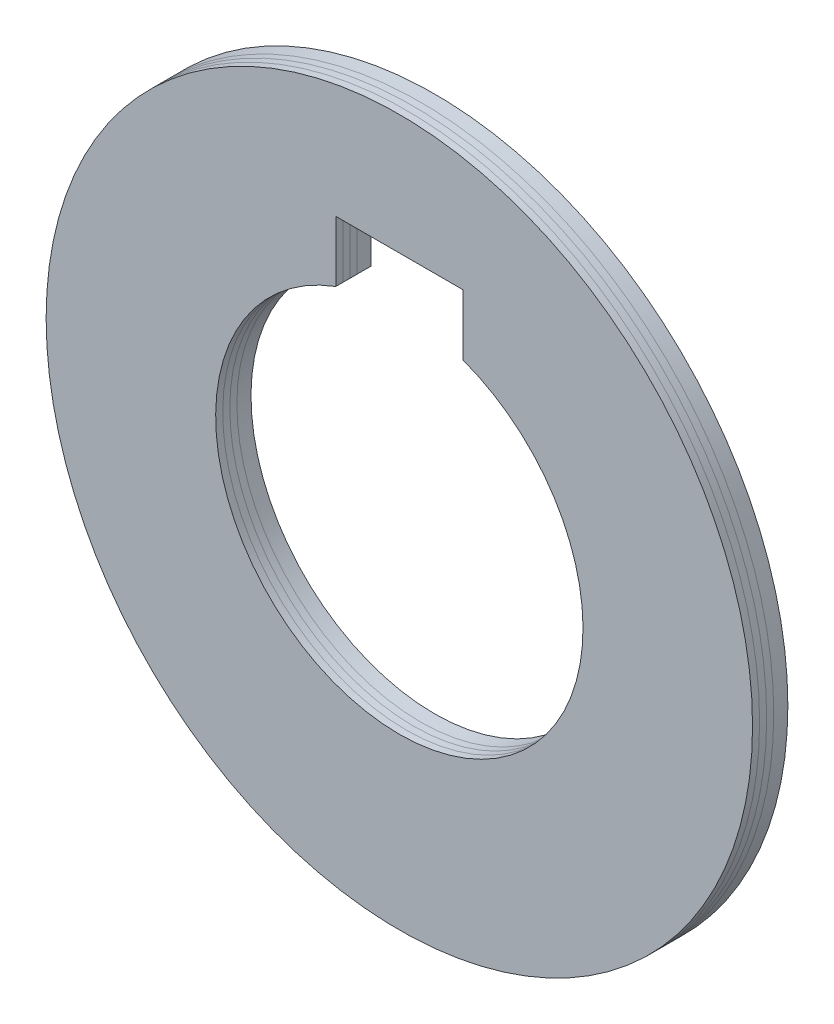
ISO-10303-21;
HEADER;
FILE_DESCRIPTION(('STEP AP214'),'2;1');
FILE_NAME('part.step','',(''),(''),'','','');
FILE_SCHEMA(('AUTOMOTIVE_DESIGN { 1 0 10303 214 1 1 1 1 }'));
ENDSEC;
DATA;
#1=APPLICATION_CONTEXT('core data for automotive mechanical design processes');
#2=APPLICATION_PROTOCOL_DEFINITION('international standard','automotive_design',2000,#1);
#3=PRODUCT_CONTEXT('',#1,'mechanical');
#4=PRODUCT('Part','Part','',(#3));
#5=PRODUCT_RELATED_PRODUCT_CATEGORY('part','',(#4));
#6=PRODUCT_DEFINITION_FORMATION('','',#4);
#7=PRODUCT_DEFINITION_CONTEXT('part definition',#1,'design');
#8=PRODUCT_DEFINITION('design','',#6,#7);
#9=PRODUCT_DEFINITION_SHAPE('','',#8);
#10=(LENGTH_UNIT() NAMED_UNIT(*) SI_UNIT(.MILLI.,.METRE.));
#11=(NAMED_UNIT(*) PLANE_ANGLE_UNIT() SI_UNIT($,.RADIAN.));
#12=(NAMED_UNIT(*) SI_UNIT($,.STERADIAN.) SOLID_ANGLE_UNIT());
#13=UNCERTAINTY_MEASURE_WITH_UNIT(LENGTH_MEASURE(1.E-05),#10,'distance_accuracy_value','');
#14=(GEOMETRIC_REPRESENTATION_CONTEXT(3) GLOBAL_UNCERTAINTY_ASSIGNED_CONTEXT((#13)) GLOBAL_UNIT_ASSIGNED_CONTEXT((#10,
#11,#12)) REPRESENTATION_CONTEXT('',''));
#15=CARTESIAN_POINT('',(0.,0.,0.));
#16=DIRECTION('',(0.,0.,1.));
#17=DIRECTION('',(1.,0.,0.));
#18=AXIS2_PLACEMENT_3D('',#15,#16,#17);
#19=CARTESIAN_POINT('',(-25.,-25.01,1.));
#20=DIRECTION('',(0.,0.,1.));
#21=DIRECTION('',(1.,0.,0.));
#22=AXIS2_PLACEMENT_3D('',#19,#20,#21);
#23=PLANE('',#22);
#24=CARTESIAN_POINT('',(0.,0.,1.));
#25=DIRECTION('',(0.,0.,1.));
#26=DIRECTION('',(1.,0.,0.));
#27=AXIS2_PLACEMENT_3D('',#24,#25,#26);
#28=CIRCLE('',#27,25.);
#29=CARTESIAN_POINT('',(25.,0.,1.));
#30=VERTEX_POINT('',#29);
#31=EDGE_CURVE('E101',#30,#30,#28,.T.);
#32=ORIENTED_EDGE('',*,*,#31,.T.);
#33=EDGE_LOOP('',(#32));
#34=FACE_BOUND('',#33,.T.);
#35=CARTESIAN_POINT('',(0.,0.,1.));
#36=DIRECTION('',(0.,0.,1.));
#37=DIRECTION('',(1.,0.,0.));
#38=AXIS2_PLACEMENT_3D('',#35,#36,#37);
#39=CIRCLE('',#38,13.);
#40=CARTESIAN_POINT('',(-4.5,12.1963109176505,1.));
#41=VERTEX_POINT('',#40);
#42=CARTESIAN_POINT('',(4.5,12.1963109176505,1.));
#43=VERTEX_POINT('',#42);
#44=EDGE_CURVE('E94',#41,#43,#39,.T.);
#45=ORIENTED_EDGE('',*,*,#44,.F.);
#46=DIRECTION('',(0.,-1.,0.));
#47=VECTOR('',#46,1.);
#48=CARTESIAN_POINT('',(-4.5,16.5,1.));
#49=LINE('',#48,#47);
#50=CARTESIAN_POINT('',(-4.5,16.5,1.));
#51=VERTEX_POINT('',#50);
#52=EDGE_CURVE('E108',#51,#41,#49,.T.);
#53=ORIENTED_EDGE('',*,*,#52,.F.);
#54=DIRECTION('',(-1.,0.,0.));
#55=VECTOR('',#54,1.);
#56=CARTESIAN_POINT('',(-4.5,16.5,1.));
#57=LINE('',#56,#55);
#58=CARTESIAN_POINT('',(4.5,16.5,1.));
#59=VERTEX_POINT('',#58);
#60=EDGE_CURVE('E97',#59,#51,#57,.T.);
#61=ORIENTED_EDGE('',*,*,#60,.F.);
#62=DIRECTION('',(0.,1.,0.));
#63=VECTOR('',#62,1.);
#64=CARTESIAN_POINT('',(4.5,16.5,1.));
#65=LINE('',#64,#63);
#66=EDGE_CURVE('E93',#43,#59,#65,.T.);
#67=ORIENTED_EDGE('',*,*,#66,.F.);
#68=EDGE_LOOP('',(#45,#53,#61,#67));
#69=FACE_BOUND('',#68,.T.);
#70=ADVANCED_FACE('F49',(#34,#69),#23,.T.);
#71=CARTESIAN_POINT('',(4.5,16.5,2.5));
#72=DIRECTION('',(-1.,0.,0.));
#73=DIRECTION('',(0.,-1.,0.));
#74=AXIS2_PLACEMENT_3D('',#71,#72,#73);
#75=PLANE('',#74);
#76=DIRECTION('',(0.,0.,-1.));
#77=VECTOR('',#76,1.);
#78=CARTESIAN_POINT('',(4.5,12.1963109176505,2.5));
#79=LINE('',#78,#77);
#80=CARTESIAN_POINT('',(4.5,12.1963109176505,0.));
#81=VERTEX_POINT('',#80);
#82=EDGE_CURVE('E53',#43,#81,#79,.T.);
#83=ORIENTED_EDGE('',*,*,#82,.F.);
#84=ORIENTED_EDGE('',*,*,#66,.T.);
#85=DIRECTION('',(0.,0.,-1.));
#86=VECTOR('',#85,1.);
#87=CARTESIAN_POINT('',(4.5,16.5,2.5));
#88=LINE('',#87,#86);
#89=CARTESIAN_POINT('',(4.5,16.5,0.));
#90=VERTEX_POINT('',#89);
#91=EDGE_CURVE('E72',#59,#90,#88,.T.);
#92=ORIENTED_EDGE('',*,*,#91,.T.);
#93=DIRECTION('',(0.,1.,0.));
#94=VECTOR('',#93,1.);
#95=CARTESIAN_POINT('',(4.5,16.5,0.));
#96=LINE('',#95,#94);
#97=EDGE_CURVE('E58',#81,#90,#96,.T.);
#98=ORIENTED_EDGE('',*,*,#97,.F.);
#99=EDGE_LOOP('',(#83,#84,#92,#98));
#100=FACE_BOUND('',#99,.T.);
#101=ADVANCED_FACE('F103',(#100),#75,.T.);
#102=CARTESIAN_POINT('',(0.,0.,0.));
#103=DIRECTION('',(0.,0.,1.));
#104=DIRECTION('',(1.,0.,0.));
#105=AXIS2_PLACEMENT_3D('',#102,#103,#104);
#106=PLANE('',#105);
#107=CARTESIAN_POINT('',(0.,0.,0.));
#108=DIRECTION('',(0.,0.,1.));
#109=DIRECTION('',(1.,0.,0.));
#110=AXIS2_PLACEMENT_3D('',#107,#108,#109);
#111=CIRCLE('',#110,25.);
#112=CARTESIAN_POINT('',(25.,0.,0.));
#113=VERTEX_POINT('',#112);
#114=EDGE_CURVE('E105',#113,#113,#111,.T.);
#115=ORIENTED_EDGE('',*,*,#114,.F.);
#116=EDGE_LOOP('',(#115));
#117=FACE_BOUND('',#116,.T.);
#118=CARTESIAN_POINT('',(0.,0.,0.));
#119=DIRECTION('',(0.,0.,1.));
#120=DIRECTION('',(1.,0.,0.));
#121=AXIS2_PLACEMENT_3D('',#118,#119,#120);
#122=CIRCLE('',#121,13.);
#123=CARTESIAN_POINT('',(-4.5,12.1963109176505,0.));
#124=VERTEX_POINT('',#123);
#125=EDGE_CURVE('E12',#124,#81,#122,.T.);
#126=ORIENTED_EDGE('',*,*,#125,.T.);
#127=ORIENTED_EDGE('',*,*,#97,.T.);
#128=DIRECTION('',(-1.,0.,0.));
#129=VECTOR('',#128,1.);
#130=CARTESIAN_POINT('',(-4.5,16.5,0.));
#131=LINE('',#130,#129);
#132=CARTESIAN_POINT('',(-4.5,16.5,0.));
#133=VERTEX_POINT('',#132);
#134=EDGE_CURVE('E117',#90,#133,#131,.T.);
#135=ORIENTED_EDGE('',*,*,#134,.T.);
#136=DIRECTION('',(0.,-1.,0.));
#137=VECTOR('',#136,1.);
#138=CARTESIAN_POINT('',(-4.5,16.5,0.));
#139=LINE('',#138,#137);
#140=EDGE_CURVE('E114',#133,#124,#139,.T.);
#141=ORIENTED_EDGE('',*,*,#140,.T.);
#142=EDGE_LOOP('',(#126,#127,#135,#141));
#143=FACE_BOUND('',#142,.T.);
#144=ADVANCED_FACE('F132',(#117,#143),#106,.F.);
#145=CARTESIAN_POINT('',(0.,0.,2.5));
#146=DIRECTION('',(0.,0.,-1.));
#147=DIRECTION('',(-1.,0.,0.));
#148=AXIS2_PLACEMENT_3D('',#145,#146,#147);
#149=CYLINDRICAL_SURFACE('',#148,13.);
#150=DIRECTION('',(0.,0.,-1.));
#151=VECTOR('',#150,1.);
#152=CARTESIAN_POINT('',(-4.5,12.1963109176505,2.5));
#153=LINE('',#152,#151);
#154=EDGE_CURVE('E100',#41,#124,#153,.T.);
#155=ORIENTED_EDGE('',*,*,#154,.F.);
#156=ORIENTED_EDGE('',*,*,#44,.T.);
#157=ORIENTED_EDGE('',*,*,#82,.T.);
#158=ORIENTED_EDGE('',*,*,#125,.F.);
#159=EDGE_LOOP('',(#155,#156,#157,#158));
#160=FACE_BOUND('',#159,.T.);
#161=ADVANCED_FACE('F99',(#160),#149,.F.);
#162=CARTESIAN_POINT('',(-4.5,16.5,2.5));
#163=DIRECTION('',(0.,-1.,0.));
#164=DIRECTION('',(0.,0.,-1.));
#165=AXIS2_PLACEMENT_3D('',#162,#163,#164);
#166=PLANE('',#165);
#167=ORIENTED_EDGE('',*,*,#91,.F.);
#168=ORIENTED_EDGE('',*,*,#60,.T.);
#169=DIRECTION('',(0.,0.,-1.));
#170=VECTOR('',#169,1.);
#171=CARTESIAN_POINT('',(-4.5,16.5,2.5));
#172=LINE('',#171,#170);
#173=EDGE_CURVE('E106',#51,#133,#172,.T.);
#174=ORIENTED_EDGE('',*,*,#173,.T.);
#175=ORIENTED_EDGE('',*,*,#134,.F.);
#176=EDGE_LOOP('',(#167,#168,#174,#175));
#177=FACE_BOUND('',#176,.T.);
#178=ADVANCED_FACE('F128',(#177),#166,.T.);
#179=CARTESIAN_POINT('',(-4.5,16.5,2.5));
#180=DIRECTION('',(1.,0.,0.));
#181=DIRECTION('',(0.,1.,0.));
#182=AXIS2_PLACEMENT_3D('',#179,#180,#181);
#183=PLANE('',#182);
#184=ORIENTED_EDGE('',*,*,#173,.F.);
#185=ORIENTED_EDGE('',*,*,#52,.T.);
#186=ORIENTED_EDGE('',*,*,#154,.T.);
#187=ORIENTED_EDGE('',*,*,#140,.F.);
#188=EDGE_LOOP('',(#184,#185,#186,#187));
#189=FACE_BOUND('',#188,.T.);
#190=ADVANCED_FACE('F130',(#189),#183,.T.);
#191=CARTESIAN_POINT('',(0.,0.,2.5));
#192=DIRECTION('',(0.,0.,-1.));
#193=DIRECTION('',(-1.,0.,0.));
#194=AXIS2_PLACEMENT_3D('',#191,#192,#193);
#195=CYLINDRICAL_SURFACE('',#194,25.);
#196=ORIENTED_EDGE('',*,*,#114,.T.);
#197=EDGE_LOOP('',(#196));
#198=FACE_BOUND('',#197,.T.);
#199=ORIENTED_EDGE('',*,*,#31,.F.);
#200=EDGE_LOOP('',(#199));
#201=FACE_BOUND('',#200,.T.);
#202=ADVANCED_FACE('F51',(#198,#201),#195,.T.);
#203=CLOSED_SHELL('',(#70,#101,#144,#161,#178,#190,#202));
#204=MANIFOLD_SOLID_BREP('B2',#203);
#205=CARTESIAN_POINT('',(-25.,-25.01,2.));
#206=DIRECTION('',(0.,0.,1.));
#207=DIRECTION('',(1.,0.,0.));
#208=AXIS2_PLACEMENT_3D('',#205,#206,#207);
#209=PLANE('',#208);
#210=CARTESIAN_POINT('',(0.,0.,2.));
#211=DIRECTION('',(0.,0.,1.));
#212=DIRECTION('',(1.,0.,0.));
#213=AXIS2_PLACEMENT_3D('',#210,#211,#212);
#214=CIRCLE('',#213,13.);
#215=CARTESIAN_POINT('',(-4.5,12.1963109176505,2.));
#216=VERTEX_POINT('',#215);
#217=CARTESIAN_POINT('',(4.5,12.1963109176505,2.));
#218=VERTEX_POINT('',#217);
#219=EDGE_CURVE('E279',#216,#218,#214,.T.);
#220=ORIENTED_EDGE('',*,*,#219,.T.);
#221=DIRECTION('',(0.,1.,0.));
#222=VECTOR('',#221,1.);
#223=CARTESIAN_POINT('',(4.5,16.5,2.));
#224=LINE('',#223,#222);
#225=CARTESIAN_POINT('',(4.5,16.5,2.));
#226=VERTEX_POINT('',#225);
#227=EDGE_CURVE('E266',#218,#226,#224,.T.);
#228=ORIENTED_EDGE('',*,*,#227,.T.);
#229=DIRECTION('',(-1.,0.,0.));
#230=VECTOR('',#229,1.);
#231=CARTESIAN_POINT('',(-4.5,16.5,2.));
#232=LINE('',#231,#230);
#233=CARTESIAN_POINT('',(-4.5,16.5,2.));
#234=VERTEX_POINT('',#233);
#235=EDGE_CURVE('E262',#226,#234,#232,.T.);
#236=ORIENTED_EDGE('',*,*,#235,.T.);
#237=DIRECTION('',(0.,-1.,0.));
#238=VECTOR('',#237,1.);
#239=CARTESIAN_POINT('',(-4.5,16.5,2.));
#240=LINE('',#239,#238);
#241=EDGE_CURVE('E251',#234,#216,#240,.T.);
#242=ORIENTED_EDGE('',*,*,#241,.T.);
#243=EDGE_LOOP('',(#220,#228,#236,#242));
#244=FACE_BOUND('',#243,.T.);
#245=CARTESIAN_POINT('',(0.,0.,2.));
#246=DIRECTION('',(0.,0.,1.));
#247=DIRECTION('',(1.,0.,0.));
#248=AXIS2_PLACEMENT_3D('',#245,#246,#247);
#249=CIRCLE('',#248,25.);
#250=CARTESIAN_POINT('',(25.,0.,2.));
#251=VERTEX_POINT('',#250);
#252=EDGE_CURVE('E281',#251,#251,#249,.T.);
#253=ORIENTED_EDGE('',*,*,#252,.F.);
#254=EDGE_LOOP('',(#253));
#255=FACE_BOUND('',#254,.T.);
#256=ADVANCED_FACE('F209',(#244,#255),#209,.F.);
#257=CARTESIAN_POINT('',(4.5,16.5,2.5));
#258=DIRECTION('',(-1.,0.,0.));
#259=DIRECTION('',(0.,-1.,0.));
#260=AXIS2_PLACEMENT_3D('',#257,#258,#259);
#261=PLANE('',#260);
#262=ORIENTED_EDGE('',*,*,#227,.F.);
#263=DIRECTION('',(0.,0.,-1.));
#264=VECTOR('',#263,1.);
#265=CARTESIAN_POINT('',(4.5,12.1963109176505,2.5));
#266=LINE('',#265,#264);
#267=CARTESIAN_POINT('',(4.5,12.1963109176505,2.5));
#268=VERTEX_POINT('',#267);
#269=EDGE_CURVE('E213',#268,#218,#266,.T.);
#270=ORIENTED_EDGE('',*,*,#269,.F.);
#271=DIRECTION('',(0.,1.,0.));
#272=VECTOR('',#271,1.);
#273=CARTESIAN_POINT('',(4.5,16.5,2.5));
#274=LINE('',#273,#272);
#275=CARTESIAN_POINT('',(4.5,16.5,2.5));
#276=VERTEX_POINT('',#275);
#277=EDGE_CURVE('E218',#268,#276,#274,.T.);
#278=ORIENTED_EDGE('',*,*,#277,.T.);
#279=DIRECTION('',(0.,0.,-1.));
#280=VECTOR('',#279,1.);
#281=CARTESIAN_POINT('',(4.5,16.5,2.5));
#282=LINE('',#281,#280);
#283=EDGE_CURVE('E273',#276,#226,#282,.T.);
#284=ORIENTED_EDGE('',*,*,#283,.T.);
#285=EDGE_LOOP('',(#262,#270,#278,#284));
#286=FACE_BOUND('',#285,.T.);
#287=ADVANCED_FACE('F292',(#286),#261,.T.);
#288=CARTESIAN_POINT('',(0.,0.,2.5));
#289=DIRECTION('',(0.,0.,-1.));
#290=DIRECTION('',(-1.,0.,0.));
#291=AXIS2_PLACEMENT_3D('',#288,#289,#290);
#292=CYLINDRICAL_SURFACE('',#291,13.);
#293=ORIENTED_EDGE('',*,*,#219,.F.);
#294=DIRECTION('',(0.,0.,-1.));
#295=VECTOR('',#294,1.);
#296=CARTESIAN_POINT('',(-4.5,12.1963109176505,2.5));
#297=LINE('',#296,#295);
#298=CARTESIAN_POINT('',(-4.5,12.1963109176505,2.5));
#299=VERTEX_POINT('',#298);
#300=EDGE_CURVE('E257',#299,#216,#297,.T.);
#301=ORIENTED_EDGE('',*,*,#300,.F.);
#302=CARTESIAN_POINT('',(0.,0.,2.5));
#303=DIRECTION('',(0.,0.,1.));
#304=DIRECTION('',(1.,0.,0.));
#305=AXIS2_PLACEMENT_3D('',#302,#303,#304);
#306=CIRCLE('',#305,13.);
#307=EDGE_CURVE('E47',#299,#268,#306,.T.);
#308=ORIENTED_EDGE('',*,*,#307,.T.);
#309=ORIENTED_EDGE('',*,*,#269,.T.);
#310=EDGE_LOOP('',(#293,#301,#308,#309));
#311=FACE_BOUND('',#310,.T.);
#312=ADVANCED_FACE('F291',(#311),#292,.F.);
#313=CARTESIAN_POINT('',(0.,0.,2.5));
#314=DIRECTION('',(0.,0.,1.));
#315=DIRECTION('',(1.,0.,0.));
#316=AXIS2_PLACEMENT_3D('',#313,#314,#315);
#317=PLANE('',#316);
#318=CARTESIAN_POINT('',(0.,0.,2.5));
#319=DIRECTION('',(0.,0.,1.));
#320=DIRECTION('',(1.,0.,0.));
#321=AXIS2_PLACEMENT_3D('',#318,#319,#320);
#322=CIRCLE('',#321,25.);
#323=CARTESIAN_POINT('',(25.,0.,2.5));
#324=VERTEX_POINT('',#323);
#325=EDGE_CURVE('E283',#324,#324,#322,.T.);
#326=ORIENTED_EDGE('',*,*,#325,.T.);
#327=EDGE_LOOP('',(#326));
#328=FACE_BOUND('',#327,.T.);
#329=ORIENTED_EDGE('',*,*,#277,.F.);
#330=ORIENTED_EDGE('',*,*,#307,.F.);
#331=DIRECTION('',(0.,-1.,0.));
#332=VECTOR('',#331,1.);
#333=CARTESIAN_POINT('',(-4.5,16.5,2.5));
#334=LINE('',#333,#332);
#335=CARTESIAN_POINT('',(-4.5,16.5,2.5));
#336=VERTEX_POINT('',#335);
#337=EDGE_CURVE('E275',#336,#299,#334,.T.);
#338=ORIENTED_EDGE('',*,*,#337,.F.);
#339=DIRECTION('',(-1.,0.,0.));
#340=VECTOR('',#339,1.);
#341=CARTESIAN_POINT('',(-4.5,16.5,2.5));
#342=LINE('',#341,#340);
#343=EDGE_CURVE('E271',#276,#336,#342,.T.);
#344=ORIENTED_EDGE('',*,*,#343,.F.);
#345=EDGE_LOOP('',(#329,#330,#338,#344));
#346=FACE_BOUND('',#345,.T.);
#347=ADVANCED_FACE('F294',(#328,#346),#317,.T.);
#348=CARTESIAN_POINT('',(-4.5,16.5,2.5));
#349=DIRECTION('',(0.,-1.,0.));
#350=DIRECTION('',(0.,0.,-1.));
#351=AXIS2_PLACEMENT_3D('',#348,#349,#350);
#352=PLANE('',#351);
#353=ORIENTED_EDGE('',*,*,#235,.F.);
#354=ORIENTED_EDGE('',*,*,#283,.F.);
#355=ORIENTED_EDGE('',*,*,#343,.T.);
#356=DIRECTION('',(0.,0.,-1.));
#357=VECTOR('',#356,1.);
#358=CARTESIAN_POINT('',(-4.5,16.5,2.5));
#359=LINE('',#358,#357);
#360=EDGE_CURVE('E255',#336,#234,#359,.T.);
#361=ORIENTED_EDGE('',*,*,#360,.T.);
#362=EDGE_LOOP('',(#353,#354,#355,#361));
#363=FACE_BOUND('',#362,.T.);
#364=ADVANCED_FACE('F269',(#363),#352,.T.);
#365=CARTESIAN_POINT('',(-4.5,16.5,2.5));
#366=DIRECTION('',(1.,0.,0.));
#367=DIRECTION('',(0.,1.,0.));
#368=AXIS2_PLACEMENT_3D('',#365,#366,#367);
#369=PLANE('',#368);
#370=ORIENTED_EDGE('',*,*,#241,.F.);
#371=ORIENTED_EDGE('',*,*,#360,.F.);
#372=ORIENTED_EDGE('',*,*,#337,.T.);
#373=ORIENTED_EDGE('',*,*,#300,.T.);
#374=EDGE_LOOP('',(#370,#371,#372,#373));
#375=FACE_BOUND('',#374,.T.);
#376=ADVANCED_FACE('F253',(#375),#369,.T.);
#377=CARTESIAN_POINT('',(0.,0.,2.5));
#378=DIRECTION('',(0.,0.,-1.));
#379=DIRECTION('',(-1.,0.,0.));
#380=AXIS2_PLACEMENT_3D('',#377,#378,#379);
#381=CYLINDRICAL_SURFACE('',#380,25.);
#382=ORIENTED_EDGE('',*,*,#252,.T.);
#383=EDGE_LOOP('',(#382));
#384=FACE_BOUND('',#383,.T.);
#385=ORIENTED_EDGE('',*,*,#325,.F.);
#386=EDGE_LOOP('',(#385));
#387=FACE_BOUND('',#386,.T.);
#388=ADVANCED_FACE('F211',(#384,#387),#381,.T.);
#389=CLOSED_SHELL('',(#256,#287,#312,#347,#364,#376,#388));
#390=MANIFOLD_SOLID_BREP('B6',#389);
#391=CARTESIAN_POINT('',(-25.,-25.01,1.));
#392=DIRECTION('',(0.,0.,1.));
#393=DIRECTION('',(1.,0.,0.));
#394=AXIS2_PLACEMENT_3D('',#391,#392,#393);
#395=PLANE('',#394);
#396=CARTESIAN_POINT('',(0.,0.,1.));
#397=DIRECTION('',(0.,0.,1.));
#398=DIRECTION('',(1.,0.,0.));
#399=AXIS2_PLACEMENT_3D('',#396,#397,#398);
#400=CIRCLE('',#399,13.);
#401=CARTESIAN_POINT('',(-4.5,12.1963109176505,1.));
#402=VERTEX_POINT('',#401);
#403=CARTESIAN_POINT('',(4.5,12.1963109176505,1.));
#404=VERTEX_POINT('',#403);
#405=EDGE_CURVE('E428',#402,#404,#400,.T.);
#406=ORIENTED_EDGE('',*,*,#405,.T.);
#407=DIRECTION('',(0.,1.,0.));
#408=VECTOR('',#407,1.);
#409=CARTESIAN_POINT('',(4.5,16.5,1.));
#410=LINE('',#409,#408);
#411=CARTESIAN_POINT('',(4.5,16.5,1.));
#412=VERTEX_POINT('',#411);
#413=EDGE_CURVE('E414',#404,#412,#410,.T.);
#414=ORIENTED_EDGE('',*,*,#413,.T.);
#415=DIRECTION('',(-1.,0.,0.));
#416=VECTOR('',#415,1.);
#417=CARTESIAN_POINT('',(-4.5,16.5,1.));
#418=LINE('',#417,#416);
#419=CARTESIAN_POINT('',(-4.5,16.5,1.));
#420=VERTEX_POINT('',#419);
#421=EDGE_CURVE('E411',#412,#420,#418,.T.);
#422=ORIENTED_EDGE('',*,*,#421,.T.);
#423=DIRECTION('',(0.,-1.,0.));
#424=VECTOR('',#423,1.);
#425=CARTESIAN_POINT('',(-4.5,16.5,1.));
#426=LINE('',#425,#424);
#427=EDGE_CURVE('E370',#420,#402,#426,.T.);
#428=ORIENTED_EDGE('',*,*,#427,.T.);
#429=EDGE_LOOP('',(#406,#414,#422,#428));
#430=FACE_BOUND('',#429,.T.);
#431=CARTESIAN_POINT('',(0.,0.,1.));
#432=DIRECTION('',(0.,0.,1.));
#433=DIRECTION('',(1.,0.,0.));
#434=AXIS2_PLACEMENT_3D('',#431,#432,#433);
#435=CIRCLE('',#434,25.);
#436=CARTESIAN_POINT('',(25.,0.,1.));
#437=VERTEX_POINT('',#436);
#438=EDGE_CURVE('E432',#437,#437,#435,.T.);
#439=ORIENTED_EDGE('',*,*,#438,.F.);
#440=EDGE_LOOP('',(#439));
#441=FACE_BOUND('',#440,.T.);
#442=ADVANCED_FACE('F366',(#430,#441),#395,.F.);
#443=CARTESIAN_POINT('',(-25.,-25.01,1.5));
#444=DIRECTION('',(0.,0.,1.));
#445=DIRECTION('',(1.,0.,0.));
#446=AXIS2_PLACEMENT_3D('',#443,#444,#445);
#447=PLANE('',#446);
#448=CARTESIAN_POINT('',(0.,0.,1.5));
#449=DIRECTION('',(0.,0.,1.));
#450=DIRECTION('',(1.,0.,0.));
#451=AXIS2_PLACEMENT_3D('',#448,#449,#450);
#452=CIRCLE('',#451,25.);
#453=CARTESIAN_POINT('',(25.,0.,1.5));
#454=VERTEX_POINT('',#453);
#455=EDGE_CURVE('E430',#454,#454,#452,.T.);
#456=ORIENTED_EDGE('',*,*,#455,.T.);
#457=EDGE_LOOP('',(#456));
#458=FACE_BOUND('',#457,.T.);
#459=CARTESIAN_POINT('',(0.,0.,1.5));
#460=DIRECTION('',(0.,0.,1.));
#461=DIRECTION('',(1.,0.,0.));
#462=AXIS2_PLACEMENT_3D('',#459,#460,#461);
#463=CIRCLE('',#462,13.);
#464=CARTESIAN_POINT('',(-4.5,12.1963109176505,1.5));
#465=VERTEX_POINT('',#464);
#466=CARTESIAN_POINT('',(4.5,12.1963109176505,1.5));
#467=VERTEX_POINT('',#466);
#468=EDGE_CURVE('E436',#465,#467,#463,.T.);
#469=ORIENTED_EDGE('',*,*,#468,.F.);
#470=DIRECTION('',(0.,-1.,0.));
#471=VECTOR('',#470,1.);
#472=CARTESIAN_POINT('',(-4.5,16.5,1.5));
#473=LINE('',#472,#471);
#474=CARTESIAN_POINT('',(-4.5,16.5,1.5));
#475=VERTEX_POINT('',#474);
#476=EDGE_CURVE('E383',#475,#465,#473,.T.);
#477=ORIENTED_EDGE('',*,*,#476,.F.);
#478=DIRECTION('',(-1.,0.,0.));
#479=VECTOR('',#478,1.);
#480=CARTESIAN_POINT('',(-4.5,16.5,1.5));
#481=LINE('',#480,#479);
#482=CARTESIAN_POINT('',(4.5,16.5,1.5));
#483=VERTEX_POINT('',#482);
#484=EDGE_CURVE('E419',#483,#475,#481,.T.);
#485=ORIENTED_EDGE('',*,*,#484,.F.);
#486=DIRECTION('',(0.,1.,0.));
#487=VECTOR('',#486,1.);
#488=CARTESIAN_POINT('',(4.5,16.5,1.5));
#489=LINE('',#488,#487);
#490=EDGE_CURVE('E441',#467,#483,#489,.T.);
#491=ORIENTED_EDGE('',*,*,#490,.F.);
#492=EDGE_LOOP('',(#469,#477,#485,#491));
#493=FACE_BOUND('',#492,.T.);
#494=ADVANCED_FACE('F450',(#458,#493),#447,.T.);
#495=CARTESIAN_POINT('',(4.5,16.5,2.5));
#496=DIRECTION('',(-1.,0.,0.));
#497=DIRECTION('',(0.,-1.,0.));
#498=AXIS2_PLACEMENT_3D('',#495,#496,#497);
#499=PLANE('',#498);
#500=DIRECTION('',(0.,0.,-1.));
#501=VECTOR('',#500,1.);
#502=CARTESIAN_POINT('',(4.5,12.1963109176505,2.5));
#503=LINE('',#502,#501);
#504=EDGE_CURVE('E422',#467,#404,#503,.T.);
#505=ORIENTED_EDGE('',*,*,#504,.F.);
#506=ORIENTED_EDGE('',*,*,#490,.T.);
#507=DIRECTION('',(0.,0.,-1.));
#508=VECTOR('',#507,1.);
#509=CARTESIAN_POINT('',(4.5,16.5,2.5));
#510=LINE('',#509,#508);
#511=EDGE_CURVE('E420',#483,#412,#510,.T.);
#512=ORIENTED_EDGE('',*,*,#511,.T.);
#513=ORIENTED_EDGE('',*,*,#413,.F.);
#514=EDGE_LOOP('',(#505,#506,#512,#513));
#515=FACE_BOUND('',#514,.T.);
#516=ADVANCED_FACE('F449',(#515),#499,.T.);
#517=CARTESIAN_POINT('',(0.,0.,2.5));
#518=DIRECTION('',(0.,0.,-1.));
#519=DIRECTION('',(-1.,0.,0.));
#520=AXIS2_PLACEMENT_3D('',#517,#518,#519);
#521=CYLINDRICAL_SURFACE('',#520,13.);
#522=DIRECTION('',(0.,0.,-1.));
#523=VECTOR('',#522,1.);
#524=CARTESIAN_POINT('',(-4.5,12.1963109176505,2.5));
#525=LINE('',#524,#523);
#526=EDGE_CURVE('E207',#465,#402,#525,.T.);
#527=ORIENTED_EDGE('',*,*,#526,.F.);
#528=ORIENTED_EDGE('',*,*,#468,.T.);
#529=ORIENTED_EDGE('',*,*,#504,.T.);
#530=ORIENTED_EDGE('',*,*,#405,.F.);
#531=EDGE_LOOP('',(#527,#528,#529,#530));
#532=FACE_BOUND('',#531,.T.);
#533=ADVANCED_FACE('F452',(#532),#521,.F.);
#534=CARTESIAN_POINT('',(-4.5,16.5,2.5));
#535=DIRECTION('',(0.,-1.,0.));
#536=DIRECTION('',(0.,0.,-1.));
#537=AXIS2_PLACEMENT_3D('',#534,#535,#536);
#538=PLANE('',#537);
#539=ORIENTED_EDGE('',*,*,#511,.F.);
#540=ORIENTED_EDGE('',*,*,#484,.T.);
#541=DIRECTION('',(0.,0.,-1.));
#542=VECTOR('',#541,1.);
#543=CARTESIAN_POINT('',(-4.5,16.5,2.5));
#544=LINE('',#543,#542);
#545=EDGE_CURVE('E375',#475,#420,#544,.T.);
#546=ORIENTED_EDGE('',*,*,#545,.T.);
#547=ORIENTED_EDGE('',*,*,#421,.F.);
#548=EDGE_LOOP('',(#539,#540,#546,#547));
#549=FACE_BOUND('',#548,.T.);
#550=ADVANCED_FACE('F418',(#549),#538,.T.);
#551=CARTESIAN_POINT('',(-4.5,16.5,2.5));
#552=DIRECTION('',(1.,0.,0.));
#553=DIRECTION('',(0.,1.,0.));
#554=AXIS2_PLACEMENT_3D('',#551,#552,#553);
#555=PLANE('',#554);
#556=ORIENTED_EDGE('',*,*,#545,.F.);
#557=ORIENTED_EDGE('',*,*,#476,.T.);
#558=ORIENTED_EDGE('',*,*,#526,.T.);
#559=ORIENTED_EDGE('',*,*,#427,.F.);
#560=EDGE_LOOP('',(#556,#557,#558,#559));
#561=FACE_BOUND('',#560,.T.);
#562=ADVANCED_FACE('F405',(#561),#555,.T.);
#563=CARTESIAN_POINT('',(0.,0.,2.5));
#564=DIRECTION('',(0.,0.,-1.));
#565=DIRECTION('',(-1.,0.,0.));
#566=AXIS2_PLACEMENT_3D('',#563,#564,#565);
#567=CYLINDRICAL_SURFACE('',#566,25.);
#568=ORIENTED_EDGE('',*,*,#438,.T.);
#569=EDGE_LOOP('',(#568));
#570=FACE_BOUND('',#569,.T.);
#571=ORIENTED_EDGE('',*,*,#455,.F.);
#572=EDGE_LOOP('',(#571));
#573=FACE_BOUND('',#572,.T.);
#574=ADVANCED_FACE('F368',(#570,#573),#567,.T.);
#575=CLOSED_SHELL('',(#442,#494,#516,#533,#550,#562,#574));
#576=MANIFOLD_SOLID_BREP('B41',#575);
#577=CARTESIAN_POINT('',(-25.,-25.01,1.5));
#578=DIRECTION('',(0.,0.,1.));
#579=DIRECTION('',(1.,0.,0.));
#580=AXIS2_PLACEMENT_3D('',#577,#578,#579);
#581=PLANE('',#580);
#582=CARTESIAN_POINT('',(0.,0.,1.5));
#583=DIRECTION('',(0.,0.,1.));
#584=DIRECTION('',(1.,0.,0.));
#585=AXIS2_PLACEMENT_3D('',#582,#583,#584);
#586=CIRCLE('',#585,13.);
#587=CARTESIAN_POINT('',(-4.5,12.1963109176505,1.5));
#588=VERTEX_POINT('',#587);
#589=CARTESIAN_POINT('',(4.5,12.1963109176505,1.5));
#590=VERTEX_POINT('',#589);
#591=EDGE_CURVE('E584',#588,#590,#586,.T.);
#592=ORIENTED_EDGE('',*,*,#591,.T.);
#593=DIRECTION('',(0.,1.,0.));
#594=VECTOR('',#593,1.);
#595=CARTESIAN_POINT('',(4.5,16.5,1.5));
#596=LINE('',#595,#594);
#597=CARTESIAN_POINT('',(4.5,16.5,1.5));
#598=VERTEX_POINT('',#597);
#599=EDGE_CURVE('E581',#590,#598,#596,.T.);
#600=ORIENTED_EDGE('',*,*,#599,.T.);
#601=DIRECTION('',(-1.,0.,0.));
#602=VECTOR('',#601,1.);
#603=CARTESIAN_POINT('',(-4.5,16.5,1.5));
#604=LINE('',#603,#602);
#605=CARTESIAN_POINT('',(-4.5,16.5,1.5));
#606=VERTEX_POINT('',#605);
#607=EDGE_CURVE('E522',#598,#606,#604,.T.);
#608=ORIENTED_EDGE('',*,*,#607,.T.);
#609=DIRECTION('',(0.,-1.,0.));
#610=VECTOR('',#609,1.);
#611=CARTESIAN_POINT('',(-4.5,16.5,1.5));
#612=LINE('',#611,#610);
#613=EDGE_CURVE('E364',#606,#588,#612,.T.);
#614=ORIENTED_EDGE('',*,*,#613,.T.);
#615=EDGE_LOOP('',(#592,#600,#608,#614));
#616=FACE_BOUND('',#615,.T.);
#617=CARTESIAN_POINT('',(0.,0.,1.5));
#618=DIRECTION('',(0.,0.,1.));
#619=DIRECTION('',(1.,0.,0.));
#620=AXIS2_PLACEMENT_3D('',#617,#618,#619);
#621=CIRCLE('',#620,25.);
#622=CARTESIAN_POINT('',(25.,0.,1.5));
#623=VERTEX_POINT('',#622);
#624=EDGE_CURVE('E586',#623,#623,#621,.T.);
#625=ORIENTED_EDGE('',*,*,#624,.F.);
#626=EDGE_LOOP('',(#625));
#627=FACE_BOUND('',#626,.T.);
#628=ADVANCED_FACE('F512',(#616,#627),#581,.F.);
#629=CARTESIAN_POINT('',(-25.,-25.01,2.));
#630=DIRECTION('',(0.,0.,1.));
#631=DIRECTION('',(1.,0.,0.));
#632=AXIS2_PLACEMENT_3D('',#629,#630,#631);
#633=PLANE('',#632);
#634=CARTESIAN_POINT('',(0.,0.,2.));
#635=DIRECTION('',(0.,0.,1.));
#636=DIRECTION('',(1.,0.,0.));
#637=AXIS2_PLACEMENT_3D('',#634,#635,#636);
#638=CIRCLE('',#637,25.);
#639=CARTESIAN_POINT('',(25.,0.,2.));
#640=VERTEX_POINT('',#639);
#641=EDGE_CURVE('E516',#640,#640,#638,.T.);
#642=ORIENTED_EDGE('',*,*,#641,.T.);
#643=EDGE_LOOP('',(#642));
#644=FACE_BOUND('',#643,.T.);
#645=CARTESIAN_POINT('',(0.,0.,2.));
#646=DIRECTION('',(0.,0.,1.));
#647=DIRECTION('',(1.,0.,0.));
#648=AXIS2_PLACEMENT_3D('',#645,#646,#647);
#649=CIRCLE('',#648,13.);
#650=CARTESIAN_POINT('',(-4.5,12.1963109176505,2.));
#651=VERTEX_POINT('',#650);
#652=CARTESIAN_POINT('',(4.5,12.1963109176505,2.));
#653=VERTEX_POINT('',#652);
#654=EDGE_CURVE('E558',#651,#653,#649,.T.);
#655=ORIENTED_EDGE('',*,*,#654,.F.);
#656=DIRECTION('',(0.,-1.,0.));
#657=VECTOR('',#656,1.);
#658=CARTESIAN_POINT('',(-4.5,16.5,2.));
#659=LINE('',#658,#657);
#660=CARTESIAN_POINT('',(-4.5,16.5,2.));
#661=VERTEX_POINT('',#660);
#662=EDGE_CURVE('E553',#661,#651,#659,.T.);
#663=ORIENTED_EDGE('',*,*,#662,.F.);
#664=DIRECTION('',(-1.,0.,0.));
#665=VECTOR('',#664,1.);
#666=CARTESIAN_POINT('',(-4.5,16.5,2.));
#667=LINE('',#666,#665);
#668=CARTESIAN_POINT('',(4.5,16.5,2.));
#669=VERTEX_POINT('',#668);
#670=EDGE_CURVE('E555',#669,#661,#667,.T.);
#671=ORIENTED_EDGE('',*,*,#670,.F.);
#672=DIRECTION('',(0.,1.,0.));
#673=VECTOR('',#672,1.);
#674=CARTESIAN_POINT('',(4.5,16.5,2.));
#675=LINE('',#674,#673);
#676=EDGE_CURVE('E570',#653,#669,#675,.T.);
#677=ORIENTED_EDGE('',*,*,#676,.F.);
#678=EDGE_LOOP('',(#655,#663,#671,#677));
#679=FACE_BOUND('',#678,.T.);
#680=ADVANCED_FACE('F514',(#644,#679),#633,.T.);
#681=CARTESIAN_POINT('',(4.5,16.5,2.5));
#682=DIRECTION('',(-1.,0.,0.));
#683=DIRECTION('',(0.,-1.,0.));
#684=AXIS2_PLACEMENT_3D('',#681,#682,#683);
#685=PLANE('',#684);
#686=DIRECTION('',(0.,0.,-1.));
#687=VECTOR('',#686,1.);
#688=CARTESIAN_POINT('',(4.5,12.1963109176505,2.5));
#689=LINE('',#688,#687);
#690=EDGE_CURVE('E561',#653,#590,#689,.T.);
#691=ORIENTED_EDGE('',*,*,#690,.F.);
#692=ORIENTED_EDGE('',*,*,#676,.T.);
#693=DIRECTION('',(0.,0.,-1.));
#694=VECTOR('',#693,1.);
#695=CARTESIAN_POINT('',(4.5,16.5,2.5));
#696=LINE('',#695,#694);
#697=EDGE_CURVE('E569',#669,#598,#696,.T.);
#698=ORIENTED_EDGE('',*,*,#697,.T.);
#699=ORIENTED_EDGE('',*,*,#599,.F.);
#700=EDGE_LOOP('',(#691,#692,#698,#699));
#701=FACE_BOUND('',#700,.T.);
#702=ADVANCED_FACE('F593',(#701),#685,.T.);
#703=CARTESIAN_POINT('',(0.,0.,2.5));
#704=DIRECTION('',(0.,0.,-1.));
#705=DIRECTION('',(-1.,0.,0.));
#706=AXIS2_PLACEMENT_3D('',#703,#704,#705);
#707=CYLINDRICAL_SURFACE('',#706,13.);
#708=DIRECTION('',(0.,0.,-1.));
#709=VECTOR('',#708,1.);
#710=CARTESIAN_POINT('',(-4.5,12.1963109176505,2.5));
#711=LINE('',#710,#709);
#712=EDGE_CURVE('E573',#651,#588,#711,.T.);
#713=ORIENTED_EDGE('',*,*,#712,.F.);
#714=ORIENTED_EDGE('',*,*,#654,.T.);
#715=ORIENTED_EDGE('',*,*,#690,.T.);
#716=ORIENTED_EDGE('',*,*,#591,.F.);
#717=EDGE_LOOP('',(#713,#714,#715,#716));
#718=FACE_BOUND('',#717,.T.);
#719=ADVANCED_FACE('F591',(#718),#707,.F.);
#720=CARTESIAN_POINT('',(-4.5,16.5,2.5));
#721=DIRECTION('',(0.,-1.,0.));
#722=DIRECTION('',(0.,0.,-1.));
#723=AXIS2_PLACEMENT_3D('',#720,#721,#722);
#724=PLANE('',#723);
#725=ORIENTED_EDGE('',*,*,#697,.F.);
#726=ORIENTED_EDGE('',*,*,#670,.T.);
#727=DIRECTION('',(0.,0.,-1.));
#728=VECTOR('',#727,1.);
#729=CARTESIAN_POINT('',(-4.5,16.5,2.5));
#730=LINE('',#729,#728);
#731=EDGE_CURVE('E567',#661,#606,#730,.T.);
#732=ORIENTED_EDGE('',*,*,#731,.T.);
#733=ORIENTED_EDGE('',*,*,#607,.F.);
#734=EDGE_LOOP('',(#725,#726,#732,#733));
#735=FACE_BOUND('',#734,.T.);
#736=ADVANCED_FACE('F566',(#735),#724,.T.);
#737=CARTESIAN_POINT('',(-4.5,16.5,2.5));
#738=DIRECTION('',(1.,0.,0.));
#739=DIRECTION('',(0.,1.,0.));
#740=AXIS2_PLACEMENT_3D('',#737,#738,#739);
#741=PLANE('',#740);
#742=ORIENTED_EDGE('',*,*,#731,.F.);
#743=ORIENTED_EDGE('',*,*,#662,.T.);
#744=ORIENTED_EDGE('',*,*,#712,.T.);
#745=ORIENTED_EDGE('',*,*,#613,.F.);
#746=EDGE_LOOP('',(#742,#743,#744,#745));
#747=FACE_BOUND('',#746,.T.);
#748=ADVANCED_FACE('F572',(#747),#741,.T.);
#749=CARTESIAN_POINT('',(0.,0.,2.5));
#750=DIRECTION('',(0.,0.,-1.));
#751=DIRECTION('',(-1.,0.,0.));
#752=AXIS2_PLACEMENT_3D('',#749,#750,#751);
#753=CYLINDRICAL_SURFACE('',#752,25.);
#754=ORIENTED_EDGE('',*,*,#624,.T.);
#755=EDGE_LOOP('',(#754));
#756=FACE_BOUND('',#755,.T.);
#757=ORIENTED_EDGE('',*,*,#641,.F.);
#758=EDGE_LOOP('',(#757));
#759=FACE_BOUND('',#758,.T.);
#760=ADVANCED_FACE('F598',(#756,#759),#753,.T.);
#761=CLOSED_SHELL('',(#628,#680,#702,#719,#736,#748,#760));
#762=MANIFOLD_SOLID_BREP('B201',#761);
#763=ADVANCED_BREP_SHAPE_REPRESENTATION('',(#18,#204,#390,#576,#762),#14);
#764=SHAPE_DEFINITION_REPRESENTATION(#9,#763);
ENDSEC;
END-ISO-10303-21;
